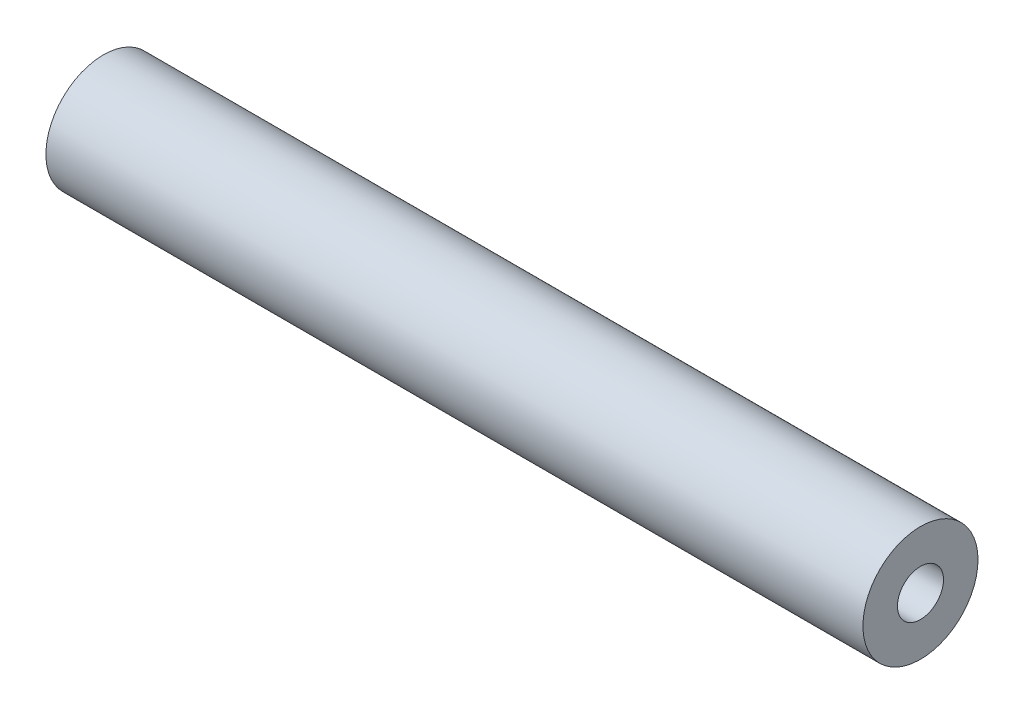
ISO-10303-21;
HEADER;
FILE_DESCRIPTION(('STEP AP214'),'2;1');
FILE_NAME('part.step','',(''),(''),'','','');
FILE_SCHEMA(('AUTOMOTIVE_DESIGN { 1 0 10303 214 1 1 1 1 }'));
ENDSEC;
DATA;
#1=APPLICATION_CONTEXT('core data for automotive mechanical design processes');
#2=APPLICATION_PROTOCOL_DEFINITION('international standard','automotive_design',2000,#1);
#3=PRODUCT_CONTEXT('',#1,'mechanical');
#4=PRODUCT('Part','Part','',(#3));
#5=PRODUCT_RELATED_PRODUCT_CATEGORY('part','',(#4));
#6=PRODUCT_DEFINITION_FORMATION('','',#4);
#7=PRODUCT_DEFINITION_CONTEXT('part definition',#1,'design');
#8=PRODUCT_DEFINITION('design','',#6,#7);
#9=PRODUCT_DEFINITION_SHAPE('','',#8);
#10=(LENGTH_UNIT() NAMED_UNIT(*) SI_UNIT(.MILLI.,.METRE.));
#11=(NAMED_UNIT(*) PLANE_ANGLE_UNIT() SI_UNIT($,.RADIAN.));
#12=(NAMED_UNIT(*) SI_UNIT($,.STERADIAN.) SOLID_ANGLE_UNIT());
#13=UNCERTAINTY_MEASURE_WITH_UNIT(LENGTH_MEASURE(1.E-05),#10,'distance_accuracy_value','');
#14=(GEOMETRIC_REPRESENTATION_CONTEXT(3) GLOBAL_UNCERTAINTY_ASSIGNED_CONTEXT((#13)) GLOBAL_UNIT_ASSIGNED_CONTEXT((#10,
#11,#12)) REPRESENTATION_CONTEXT('',''));
#15=CARTESIAN_POINT('',(0.,0.,0.));
#16=DIRECTION('',(0.,0.,1.));
#17=DIRECTION('',(1.,0.,0.));
#18=AXIS2_PLACEMENT_3D('',#15,#16,#17);
#19=CARTESIAN_POINT('',(225.425,0.,0.));
#20=DIRECTION('',(1.,0.,0.));
#21=DIRECTION('',(0.,0.,-1.));
#22=AXIS2_PLACEMENT_3D('',#19,#20,#21);
#23=PLANE('',#22);
#24=CARTESIAN_POINT('',(225.425,0.,0.));
#25=DIRECTION('',(1.,0.,0.));
#26=DIRECTION('',(0.,0.,-1.));
#27=AXIS2_PLACEMENT_3D('',#24,#25,#26);
#28=CIRCLE('',#27,31.75);
#29=CARTESIAN_POINT('',(225.425,0.,-31.75));
#30=VERTEX_POINT('',#29);
#31=EDGE_CURVE('E10',#30,#30,#28,.T.);
#32=ORIENTED_EDGE('',*,*,#31,.T.);
#33=EDGE_LOOP('',(#32));
#34=FACE_BOUND('',#33,.T.);
#35=CARTESIAN_POINT('',(225.425,0.,0.));
#36=DIRECTION('',(1.,0.,0.));
#37=DIRECTION('',(0.,0.,-1.));
#38=AXIS2_PLACEMENT_3D('',#35,#36,#37);
#39=CIRCLE('',#38,12.7);
#40=CARTESIAN_POINT('',(225.425,0.,-12.7));
#41=VERTEX_POINT('',#40);
#42=EDGE_CURVE('E52',#41,#41,#39,.T.);
#43=ORIENTED_EDGE('',*,*,#42,.F.);
#44=EDGE_LOOP('',(#43));
#45=FACE_BOUND('',#44,.T.);
#46=ADVANCED_FACE('F41',(#34,#45),#23,.T.);
#47=CARTESIAN_POINT('',(-225.425,0.,0.));
#48=DIRECTION('',(1.,0.,0.));
#49=DIRECTION('',(0.,0.,-1.));
#50=AXIS2_PLACEMENT_3D('',#47,#48,#49);
#51=PLANE('',#50);
#52=CARTESIAN_POINT('',(-225.425,0.,0.));
#53=DIRECTION('',(1.,0.,0.));
#54=DIRECTION('',(0.,0.,-1.));
#55=AXIS2_PLACEMENT_3D('',#52,#53,#54);
#56=CIRCLE('',#55,31.75);
#57=CARTESIAN_POINT('',(-225.425,0.,-31.75));
#58=VERTEX_POINT('',#57);
#59=EDGE_CURVE('E45',#58,#58,#56,.T.);
#60=ORIENTED_EDGE('',*,*,#59,.F.);
#61=EDGE_LOOP('',(#60));
#62=FACE_BOUND('',#61,.T.);
#63=CARTESIAN_POINT('',(-225.425,0.,0.));
#64=DIRECTION('',(1.,0.,0.));
#65=DIRECTION('',(0.,0.,-1.));
#66=AXIS2_PLACEMENT_3D('',#63,#64,#65);
#67=CIRCLE('',#66,12.7);
#68=CARTESIAN_POINT('',(-225.425,0.,-12.7));
#69=VERTEX_POINT('',#68);
#70=EDGE_CURVE('E54',#69,#69,#67,.T.);
#71=ORIENTED_EDGE('',*,*,#70,.T.);
#72=EDGE_LOOP('',(#71));
#73=FACE_BOUND('',#72,.T.);
#74=ADVANCED_FACE('F64',(#62,#73),#51,.F.);
#75=CARTESIAN_POINT('',(225.425,0.,0.));
#76=DIRECTION('',(-1.,0.,0.));
#77=DIRECTION('',(0.,0.,1.));
#78=AXIS2_PLACEMENT_3D('',#75,#76,#77);
#79=CYLINDRICAL_SURFACE('',#78,31.75);
#80=ORIENTED_EDGE('',*,*,#31,.F.);
#81=EDGE_LOOP('',(#80));
#82=FACE_BOUND('',#81,.T.);
#83=ORIENTED_EDGE('',*,*,#59,.T.);
#84=EDGE_LOOP('',(#83));
#85=FACE_BOUND('',#84,.T.);
#86=ADVANCED_FACE('F43',(#82,#85),#79,.T.);
#87=CARTESIAN_POINT('',(225.425,0.,0.));
#88=DIRECTION('',(-1.,0.,0.));
#89=DIRECTION('',(0.,0.,1.));
#90=AXIS2_PLACEMENT_3D('',#87,#88,#89);
#91=CYLINDRICAL_SURFACE('',#90,12.7);
#92=ORIENTED_EDGE('',*,*,#42,.T.);
#93=EDGE_LOOP('',(#92));
#94=FACE_BOUND('',#93,.T.);
#95=ORIENTED_EDGE('',*,*,#70,.F.);
#96=EDGE_LOOP('',(#95));
#97=FACE_BOUND('',#96,.T.);
#98=ADVANCED_FACE('F60',(#94,#97),#91,.F.);
#99=CLOSED_SHELL('',(#46,#74,#86,#98));
#100=MANIFOLD_SOLID_BREP('B2',#99);
#101=ADVANCED_BREP_SHAPE_REPRESENTATION('',(#18,#100),#14);
#102=SHAPE_DEFINITION_REPRESENTATION(#9,#101);
ENDSEC;
END-ISO-10303-21;
